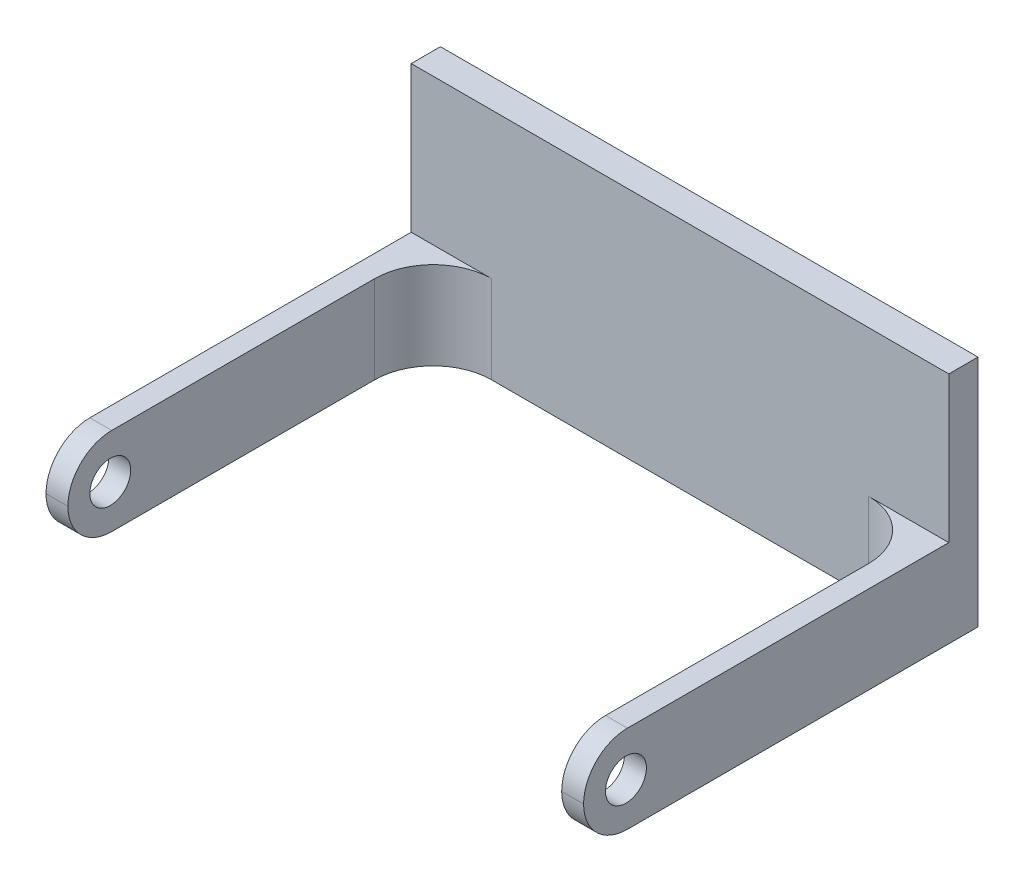
ISO-10303-21;
HEADER;
FILE_DESCRIPTION(('STEP AP214'),'2;1');
FILE_NAME('part.step','',(''),(''),'','','');
FILE_SCHEMA(('AUTOMOTIVE_DESIGN { 1 0 10303 214 1 1 1 1 }'));
ENDSEC;
DATA;
#1=APPLICATION_CONTEXT('core data for automotive mechanical design processes');
#2=APPLICATION_PROTOCOL_DEFINITION('international standard','automotive_design',2000,#1);
#3=PRODUCT_CONTEXT('',#1,'mechanical');
#4=PRODUCT('Part','Part','',(#3));
#5=PRODUCT_RELATED_PRODUCT_CATEGORY('part','',(#4));
#6=PRODUCT_DEFINITION_FORMATION('','',#4);
#7=PRODUCT_DEFINITION_CONTEXT('part definition',#1,'design');
#8=PRODUCT_DEFINITION('design','',#6,#7);
#9=PRODUCT_DEFINITION_SHAPE('','',#8);
#10=(LENGTH_UNIT() NAMED_UNIT(*) SI_UNIT(.MILLI.,.METRE.));
#11=(NAMED_UNIT(*) PLANE_ANGLE_UNIT() SI_UNIT($,.RADIAN.));
#12=(NAMED_UNIT(*) SI_UNIT($,.STERADIAN.) SOLID_ANGLE_UNIT());
#13=UNCERTAINTY_MEASURE_WITH_UNIT(LENGTH_MEASURE(1.E-05),#10,'distance_accuracy_value','');
#14=(GEOMETRIC_REPRESENTATION_CONTEXT(3) GLOBAL_UNCERTAINTY_ASSIGNED_CONTEXT((#13)) GLOBAL_UNIT_ASSIGNED_CONTEXT((#10,
#11,#12)) REPRESENTATION_CONTEXT('',''));
#15=CARTESIAN_POINT('',(0.,0.,0.));
#16=DIRECTION('',(0.,0.,1.));
#17=DIRECTION('',(1.,0.,0.));
#18=AXIS2_PLACEMENT_3D('',#15,#16,#17);
#19=CARTESIAN_POINT('',(-18.4,3.,2.));
#20=DIRECTION('',(0.,-1.,0.));
#21=DIRECTION('',(0.,0.,-1.));
#22=AXIS2_PLACEMENT_3D('',#19,#20,#21);
#23=PLANE('',#22);
#24=DIRECTION('',(1.,0.,0.));
#25=VECTOR('',#24,1.);
#26=CARTESIAN_POINT('',(-18.4,3.,2.));
#27=LINE('',#26,#25);
#28=CARTESIAN_POINT('',(-18.4,3.,2.));
#29=VERTEX_POINT('',#28);
#30=CARTESIAN_POINT('',(-12.9,3.,2.));
#31=VERTEX_POINT('',#30);
#32=EDGE_CURVE('E158',#29,#31,#27,.T.);
#33=ORIENTED_EDGE('',*,*,#32,.F.);
#34=DIRECTION('',(0.,0.,-1.));
#35=VECTOR('',#34,1.);
#36=CARTESIAN_POINT('',(-18.4,3.,2.));
#37=LINE('',#36,#35);
#38=CARTESIAN_POINT('',(-18.4,3.,24.));
#39=VERTEX_POINT('',#38);
#40=EDGE_CURVE('E164',#39,#29,#37,.T.);
#41=ORIENTED_EDGE('',*,*,#40,.F.);
#42=DIRECTION('',(-1.,0.,0.));
#43=VECTOR('',#42,1.);
#44=CARTESIAN_POINT('',(-16.9,3.,24.));
#45=LINE('',#44,#43);
#46=CARTESIAN_POINT('',(-16.9,3.,24.));
#47=VERTEX_POINT('',#46);
#48=EDGE_CURVE('E238',#39,#47,#45,.F.);
#49=ORIENTED_EDGE('',*,*,#48,.T.);
#50=DIRECTION('',(0.,0.,-1.));
#51=VECTOR('',#50,1.);
#52=CARTESIAN_POINT('',(-16.9,3.,27.));
#53=LINE('',#52,#51);
#54=CARTESIAN_POINT('',(-16.9,3.,6.));
#55=VERTEX_POINT('',#54);
#56=EDGE_CURVE('E209',#47,#55,#53,.T.);
#57=ORIENTED_EDGE('',*,*,#56,.T.);
#58=CARTESIAN_POINT('',(-12.9,3.,6.));
#59=DIRECTION('',(0.,-1.,0.));
#60=DIRECTION('',(0.,0.,-1.));
#61=AXIS2_PLACEMENT_3D('',#58,#59,#60);
#62=CIRCLE('',#61,4.);
#63=EDGE_CURVE('E42',#55,#31,#62,.T.);
#64=ORIENTED_EDGE('',*,*,#63,.T.);
#65=EDGE_LOOP('',(#33,#41,#49,#57,#64));
#66=FACE_BOUND('',#65,.T.);
#67=ADVANCED_FACE('F34',(#66),#23,.F.);
#68=CARTESIAN_POINT('',(12.9,3.,2.));
#69=VERTEX_POINT('',#68);
#70=CARTESIAN_POINT('',(18.4,3.,2.));
#71=VERTEX_POINT('',#70);
#72=EDGE_CURVE('E174',#69,#71,#27,.T.);
#73=ORIENTED_EDGE('',*,*,#72,.F.);
#74=CARTESIAN_POINT('',(12.9,3.,6.));
#75=DIRECTION('',(0.,-1.,0.));
#76=DIRECTION('',(0.,0.,-1.));
#77=AXIS2_PLACEMENT_3D('',#74,#75,#76);
#78=CIRCLE('',#77,4.);
#79=CARTESIAN_POINT('',(16.9,3.,6.));
#80=VERTEX_POINT('',#79);
#81=EDGE_CURVE('E323',#69,#80,#78,.T.);
#82=ORIENTED_EDGE('',*,*,#81,.T.);
#83=DIRECTION('',(0.,0.,-1.));
#84=VECTOR('',#83,1.);
#85=CARTESIAN_POINT('',(16.9,3.,27.));
#86=LINE('',#85,#84);
#87=CARTESIAN_POINT('',(16.9,3.,24.));
#88=VERTEX_POINT('',#87);
#89=EDGE_CURVE('E212',#88,#80,#86,.T.);
#90=ORIENTED_EDGE('',*,*,#89,.F.);
#91=DIRECTION('',(-1.,0.,0.));
#92=VECTOR('',#91,1.);
#93=CARTESIAN_POINT('',(-18.4,3.,24.));
#94=LINE('',#93,#92);
#95=CARTESIAN_POINT('',(18.4,3.,24.));
#96=VERTEX_POINT('',#95);
#97=EDGE_CURVE('E236',#88,#96,#94,.F.);
#98=ORIENTED_EDGE('',*,*,#97,.T.);
#99=DIRECTION('',(0.,0.,-1.));
#100=VECTOR('',#99,1.);
#101=CARTESIAN_POINT('',(18.4,3.,2.));
#102=LINE('',#101,#100);
#103=EDGE_CURVE('E201',#96,#71,#102,.T.);
#104=ORIENTED_EDGE('',*,*,#103,.T.);
#105=EDGE_LOOP('',(#73,#82,#90,#98,#104));
#106=FACE_BOUND('',#105,.T.);
#107=ADVANCED_FACE('F285',(#106),#23,.F.);
#108=CARTESIAN_POINT('',(0.,0.,2.));
#109=DIRECTION('',(0.,0.,-1.));
#110=DIRECTION('',(-1.,0.,0.));
#111=AXIS2_PLACEMENT_3D('',#108,#109,#110);
#112=PLANE('',#111);
#113=DIRECTION('',(1.,0.,0.));
#114=VECTOR('',#113,1.);
#115=CARTESIAN_POINT('',(-18.4,-3.,2.));
#116=LINE('',#115,#114);
#117=CARTESIAN_POINT('',(-12.9,-3.,2.));
#118=VERTEX_POINT('',#117);
#119=CARTESIAN_POINT('',(12.9,-3.,2.));
#120=VERTEX_POINT('',#119);
#121=EDGE_CURVE('E190',#118,#120,#116,.T.);
#122=ORIENTED_EDGE('',*,*,#121,.T.);
#123=DIRECTION('',(0.,-1.,0.));
#124=VECTOR('',#123,1.);
#125=CARTESIAN_POINT('',(12.9,3.,2.));
#126=LINE('',#125,#124);
#127=EDGE_CURVE('E325',#120,#69,#126,.F.);
#128=ORIENTED_EDGE('',*,*,#127,.T.);
#129=ORIENTED_EDGE('',*,*,#72,.T.);
#130=DIRECTION('',(0.,-1.,0.));
#131=VECTOR('',#130,1.);
#132=CARTESIAN_POINT('',(18.4,13.,2.));
#133=LINE('',#132,#131);
#134=CARTESIAN_POINT('',(18.4,13.,2.));
#135=VERTEX_POINT('',#134);
#136=EDGE_CURVE('E144',#135,#71,#133,.T.);
#137=ORIENTED_EDGE('',*,*,#136,.F.);
#138=DIRECTION('',(1.,0.,0.));
#139=VECTOR('',#138,1.);
#140=CARTESIAN_POINT('',(-18.4,13.,2.));
#141=LINE('',#140,#139);
#142=CARTESIAN_POINT('',(-18.4,13.,2.));
#143=VERTEX_POINT('',#142);
#144=EDGE_CURVE('E136',#143,#135,#141,.T.);
#145=ORIENTED_EDGE('',*,*,#144,.F.);
#146=DIRECTION('',(0.,-1.,0.));
#147=VECTOR('',#146,1.);
#148=CARTESIAN_POINT('',(-18.4,13.,2.));
#149=LINE('',#148,#147);
#150=EDGE_CURVE('E141',#143,#29,#149,.T.);
#151=ORIENTED_EDGE('',*,*,#150,.T.);
#152=ORIENTED_EDGE('',*,*,#32,.T.);
#153=DIRECTION('',(0.,1.,0.));
#154=VECTOR('',#153,1.);
#155=CARTESIAN_POINT('',(-12.9,-3.,2.));
#156=LINE('',#155,#154);
#157=EDGE_CURVE('E246',#31,#118,#156,.F.);
#158=ORIENTED_EDGE('',*,*,#157,.T.);
#159=EDGE_LOOP('',(#122,#128,#129,#137,#145,#151,#152,#158));
#160=FACE_BOUND('',#159,.T.);
#161=ADVANCED_FACE('F139',(#160),#112,.F.);
#162=CARTESIAN_POINT('',(18.4,-3.,2.));
#163=DIRECTION('',(-1.,0.,0.));
#164=DIRECTION('',(0.,0.,1.));
#165=AXIS2_PLACEMENT_3D('',#162,#163,#164);
#166=PLANE('',#165);
#167=CARTESIAN_POINT('',(18.4,0.,24.1));
#168=DIRECTION('',(1.,0.,0.));
#169=DIRECTION('',(0.,0.,-1.));
#170=AXIS2_PLACEMENT_3D('',#167,#168,#169);
#171=CIRCLE('',#170,1.4);
#172=CARTESIAN_POINT('',(18.4,0.,22.7));
#173=VERTEX_POINT('',#172);
#174=EDGE_CURVE('E242',#173,#173,#171,.T.);
#175=ORIENTED_EDGE('',*,*,#174,.F.);
#176=EDGE_LOOP('',(#175));
#177=FACE_BOUND('',#176,.T.);
#178=CARTESIAN_POINT('',(18.4,0.,24.));
#179=DIRECTION('',(-1.,0.,0.));
#180=DIRECTION('',(0.,0.,1.));
#181=AXIS2_PLACEMENT_3D('',#178,#179,#180);
#182=CIRCLE('',#181,3.);
#183=CARTESIAN_POINT('',(18.4,0.,27.));
#184=VERTEX_POINT('',#183);
#185=EDGE_CURVE('E228',#96,#184,#182,.F.);
#186=ORIENTED_EDGE('',*,*,#185,.T.);
#187=CARTESIAN_POINT('',(18.4,0.,24.));
#188=DIRECTION('',(-1.,0.,0.));
#189=DIRECTION('',(0.,0.,1.));
#190=AXIS2_PLACEMENT_3D('',#187,#188,#189);
#191=CIRCLE('',#190,3.);
#192=CARTESIAN_POINT('',(18.4,-3.,24.));
#193=VERTEX_POINT('',#192);
#194=EDGE_CURVE('E230',#184,#193,#191,.F.);
#195=ORIENTED_EDGE('',*,*,#194,.T.);
#196=DIRECTION('',(0.,0.,-1.));
#197=VECTOR('',#196,1.);
#198=CARTESIAN_POINT('',(18.4,-3.,2.));
#199=LINE('',#198,#197);
#200=CARTESIAN_POINT('',(18.4,-3.,0.));
#201=VERTEX_POINT('',#200);
#202=EDGE_CURVE('E196',#193,#201,#199,.T.);
#203=ORIENTED_EDGE('',*,*,#202,.T.);
#204=DIRECTION('',(0.,1.,0.));
#205=VECTOR('',#204,1.);
#206=CARTESIAN_POINT('',(18.4,-3.,0.));
#207=LINE('',#206,#205);
#208=CARTESIAN_POINT('',(18.4,13.,0.));
#209=VERTEX_POINT('',#208);
#210=EDGE_CURVE('E185',#201,#209,#207,.T.);
#211=ORIENTED_EDGE('',*,*,#210,.T.);
#212=DIRECTION('',(0.,0.,-1.));
#213=VECTOR('',#212,1.);
#214=CARTESIAN_POINT('',(18.4,13.,0.));
#215=LINE('',#214,#213);
#216=EDGE_CURVE('E148',#135,#209,#215,.T.);
#217=ORIENTED_EDGE('',*,*,#216,.F.);
#218=ORIENTED_EDGE('',*,*,#136,.T.);
#219=ORIENTED_EDGE('',*,*,#103,.F.);
#220=EDGE_LOOP('',(#186,#195,#203,#211,#217,#218,#219));
#221=FACE_BOUND('',#220,.T.);
#222=ADVANCED_FACE('F295',(#177,#221),#166,.F.);
#223=CARTESIAN_POINT('',(-18.4,-3.,2.));
#224=DIRECTION('',(1.,0.,0.));
#225=DIRECTION('',(0.,0.,-1.));
#226=AXIS2_PLACEMENT_3D('',#223,#224,#225);
#227=PLANE('',#226);
#228=CARTESIAN_POINT('',(-18.4,0.,24.1));
#229=DIRECTION('',(1.,0.,0.));
#230=DIRECTION('',(0.,0.,-1.));
#231=AXIS2_PLACEMENT_3D('',#228,#229,#230);
#232=CIRCLE('',#231,1.4);
#233=CARTESIAN_POINT('',(-18.4,0.,22.7));
#234=VERTEX_POINT('',#233);
#235=EDGE_CURVE('E260',#234,#234,#232,.T.);
#236=ORIENTED_EDGE('',*,*,#235,.T.);
#237=EDGE_LOOP('',(#236));
#238=FACE_BOUND('',#237,.T.);
#239=DIRECTION('',(0.,0.,-1.));
#240=VECTOR('',#239,1.);
#241=CARTESIAN_POINT('',(-18.4,-3.,2.));
#242=LINE('',#241,#240);
#243=CARTESIAN_POINT('',(-18.4,-3.,24.));
#244=VERTEX_POINT('',#243);
#245=CARTESIAN_POINT('',(-18.4,-3.,0.));
#246=VERTEX_POINT('',#245);
#247=EDGE_CURVE('E198',#244,#246,#242,.T.);
#248=ORIENTED_EDGE('',*,*,#247,.F.);
#249=CARTESIAN_POINT('',(-18.4,0.,24.));
#250=DIRECTION('',(1.,0.,0.));
#251=DIRECTION('',(0.,0.,-1.));
#252=AXIS2_PLACEMENT_3D('',#249,#250,#251);
#253=CIRCLE('',#252,3.);
#254=CARTESIAN_POINT('',(-18.4,0.,27.));
#255=VERTEX_POINT('',#254);
#256=EDGE_CURVE('E226',#244,#255,#253,.F.);
#257=ORIENTED_EDGE('',*,*,#256,.T.);
#258=CARTESIAN_POINT('',(-18.4,0.,24.));
#259=DIRECTION('',(1.,0.,0.));
#260=DIRECTION('',(0.,0.,-1.));
#261=AXIS2_PLACEMENT_3D('',#258,#259,#260);
#262=CIRCLE('',#261,3.);
#263=EDGE_CURVE('E224',#255,#39,#262,.F.);
#264=ORIENTED_EDGE('',*,*,#263,.T.);
#265=ORIENTED_EDGE('',*,*,#40,.T.);
#266=ORIENTED_EDGE('',*,*,#150,.F.);
#267=DIRECTION('',(0.,0.,1.));
#268=VECTOR('',#267,1.);
#269=CARTESIAN_POINT('',(-18.4,13.,0.));
#270=LINE('',#269,#268);
#271=CARTESIAN_POINT('',(-18.4,13.,0.));
#272=VERTEX_POINT('',#271);
#273=EDGE_CURVE('E149',#272,#143,#270,.T.);
#274=ORIENTED_EDGE('',*,*,#273,.F.);
#275=DIRECTION('',(0.,-1.,0.));
#276=VECTOR('',#275,1.);
#277=CARTESIAN_POINT('',(-18.4,-3.,0.));
#278=LINE('',#277,#276);
#279=EDGE_CURVE('E186',#272,#246,#278,.T.);
#280=ORIENTED_EDGE('',*,*,#279,.T.);
#281=EDGE_LOOP('',(#248,#257,#264,#265,#266,#274,#280));
#282=FACE_BOUND('',#281,.T.);
#283=ADVANCED_FACE('F162',(#238,#282),#227,.F.);
#284=CARTESIAN_POINT('',(-18.4,-3.,2.));
#285=DIRECTION('',(0.,1.,0.));
#286=DIRECTION('',(0.,0.,1.));
#287=AXIS2_PLACEMENT_3D('',#284,#285,#286);
#288=PLANE('',#287);
#289=DIRECTION('',(0.,0.,-1.));
#290=VECTOR('',#289,1.);
#291=CARTESIAN_POINT('',(-16.9,-3.,27.));
#292=LINE('',#291,#290);
#293=CARTESIAN_POINT('',(-16.9,-3.,24.));
#294=VERTEX_POINT('',#293);
#295=CARTESIAN_POINT('',(-16.9,-3.,6.));
#296=VERTEX_POINT('',#295);
#297=EDGE_CURVE('E192',#294,#296,#292,.T.);
#298=ORIENTED_EDGE('',*,*,#297,.F.);
#299=DIRECTION('',(1.,0.,0.));
#300=VECTOR('',#299,1.);
#301=CARTESIAN_POINT('',(-18.4,-3.,24.));
#302=LINE('',#301,#300);
#303=EDGE_CURVE('E221',#294,#244,#302,.F.);
#304=ORIENTED_EDGE('',*,*,#303,.T.);
#305=ORIENTED_EDGE('',*,*,#247,.T.);
#306=DIRECTION('',(1.,0.,0.));
#307=VECTOR('',#306,1.);
#308=CARTESIAN_POINT('',(-18.4,-3.,0.));
#309=LINE('',#308,#307);
#310=EDGE_CURVE('E188',#246,#201,#309,.T.);
#311=ORIENTED_EDGE('',*,*,#310,.T.);
#312=ORIENTED_EDGE('',*,*,#202,.F.);
#313=DIRECTION('',(1.,0.,0.));
#314=VECTOR('',#313,1.);
#315=CARTESIAN_POINT('',(-18.4,-3.,24.));
#316=LINE('',#315,#314);
#317=CARTESIAN_POINT('',(16.9,-3.,24.));
#318=VERTEX_POINT('',#317);
#319=EDGE_CURVE('E218',#193,#318,#316,.F.);
#320=ORIENTED_EDGE('',*,*,#319,.T.);
#321=DIRECTION('',(0.,0.,-1.));
#322=VECTOR('',#321,1.);
#323=CARTESIAN_POINT('',(16.9,-3.,27.));
#324=LINE('',#323,#322);
#325=CARTESIAN_POINT('',(16.9,-3.,6.));
#326=VERTEX_POINT('',#325);
#327=EDGE_CURVE('E253',#318,#326,#324,.T.);
#328=ORIENTED_EDGE('',*,*,#327,.T.);
#329=CARTESIAN_POINT('',(12.9,-3.,6.));
#330=DIRECTION('',(0.,1.,0.));
#331=DIRECTION('',(0.,0.,1.));
#332=AXIS2_PLACEMENT_3D('',#329,#330,#331);
#333=CIRCLE('',#332,4.);
#334=EDGE_CURVE('E327',#326,#120,#333,.T.);
#335=ORIENTED_EDGE('',*,*,#334,.T.);
#336=ORIENTED_EDGE('',*,*,#121,.F.);
#337=CARTESIAN_POINT('',(-12.9,-3.,6.));
#338=DIRECTION('',(0.,1.,0.));
#339=DIRECTION('',(0.,0.,1.));
#340=AXIS2_PLACEMENT_3D('',#337,#338,#339);
#341=CIRCLE('',#340,4.);
#342=EDGE_CURVE('E11',#118,#296,#341,.T.);
#343=ORIENTED_EDGE('',*,*,#342,.T.);
#344=EDGE_LOOP('',(#298,#304,#305,#311,#312,#320,#328,#335,#336,#343));
#345=FACE_BOUND('',#344,.T.);
#346=ADVANCED_FACE('F332',(#345),#288,.F.);
#347=CARTESIAN_POINT('',(0.,0.,0.));
#348=DIRECTION('',(0.,0.,-1.));
#349=DIRECTION('',(-1.,0.,0.));
#350=AXIS2_PLACEMENT_3D('',#347,#348,#349);
#351=PLANE('',#350);
#352=ORIENTED_EDGE('',*,*,#210,.F.);
#353=ORIENTED_EDGE('',*,*,#310,.F.);
#354=ORIENTED_EDGE('',*,*,#279,.F.);
#355=DIRECTION('',(-1.,0.,0.));
#356=VECTOR('',#355,1.);
#357=CARTESIAN_POINT('',(-18.4,13.,0.));
#358=LINE('',#357,#356);
#359=EDGE_CURVE('E155',#209,#272,#358,.T.);
#360=ORIENTED_EDGE('',*,*,#359,.F.);
#361=EDGE_LOOP('',(#352,#353,#354,#360));
#362=FACE_BOUND('',#361,.T.);
#363=ADVANCED_FACE('F183',(#362),#351,.T.);
#364=CARTESIAN_POINT('',(-16.9,3.,27.));
#365=DIRECTION('',(-1.,0.,0.));
#366=DIRECTION('',(0.,0.,1.));
#367=AXIS2_PLACEMENT_3D('',#364,#365,#366);
#368=PLANE('',#367);
#369=CARTESIAN_POINT('',(-16.9,0.,24.1));
#370=DIRECTION('',(-1.,0.,0.));
#371=DIRECTION('',(0.,0.,1.));
#372=AXIS2_PLACEMENT_3D('',#369,#370,#371);
#373=CIRCLE('',#372,1.4);
#374=CARTESIAN_POINT('',(-16.9,0.,25.5));
#375=VERTEX_POINT('',#374);
#376=EDGE_CURVE('E256',#375,#375,#373,.T.);
#377=ORIENTED_EDGE('',*,*,#376,.T.);
#378=EDGE_LOOP('',(#377));
#379=FACE_BOUND('',#378,.T.);
#380=ORIENTED_EDGE('',*,*,#297,.T.);
#381=DIRECTION('',(0.,1.,0.));
#382=VECTOR('',#381,1.);
#383=CARTESIAN_POINT('',(-16.9,3.,6.));
#384=LINE('',#383,#382);
#385=EDGE_CURVE('E329',#296,#55,#384,.T.);
#386=ORIENTED_EDGE('',*,*,#385,.T.);
#387=ORIENTED_EDGE('',*,*,#56,.F.);
#388=CARTESIAN_POINT('',(-16.9,0.,24.));
#389=DIRECTION('',(-1.,0.,0.));
#390=DIRECTION('',(0.,0.,1.));
#391=AXIS2_PLACEMENT_3D('',#388,#389,#390);
#392=CIRCLE('',#391,3.);
#393=CARTESIAN_POINT('',(-16.9,0.,27.));
#394=VERTEX_POINT('',#393);
#395=EDGE_CURVE('E203',#47,#394,#392,.F.);
#396=ORIENTED_EDGE('',*,*,#395,.T.);
#397=CARTESIAN_POINT('',(-16.9,0.,24.));
#398=DIRECTION('',(-1.,0.,0.));
#399=DIRECTION('',(0.,0.,1.));
#400=AXIS2_PLACEMENT_3D('',#397,#398,#399);
#401=CIRCLE('',#400,3.);
#402=EDGE_CURVE('E216',#394,#294,#401,.F.);
#403=ORIENTED_EDGE('',*,*,#402,.T.);
#404=EDGE_LOOP('',(#380,#386,#387,#396,#403));
#405=FACE_BOUND('',#404,.T.);
#406=ADVANCED_FACE('F281',(#379,#405),#368,.F.);
#407=CARTESIAN_POINT('',(16.9,3.,27.));
#408=DIRECTION('',(1.,0.,0.));
#409=DIRECTION('',(0.,0.,-1.));
#410=AXIS2_PLACEMENT_3D('',#407,#408,#409);
#411=PLANE('',#410);
#412=CARTESIAN_POINT('',(16.9,0.,24.1));
#413=DIRECTION('',(1.,0.,0.));
#414=DIRECTION('',(0.,0.,-1.));
#415=AXIS2_PLACEMENT_3D('',#412,#413,#414);
#416=CIRCLE('',#415,1.4);
#417=CARTESIAN_POINT('',(16.9,0.,22.7));
#418=VERTEX_POINT('',#417);
#419=EDGE_CURVE('E213',#418,#418,#416,.T.);
#420=ORIENTED_EDGE('',*,*,#419,.T.);
#421=EDGE_LOOP('',(#420));
#422=FACE_BOUND('',#421,.T.);
#423=ORIENTED_EDGE('',*,*,#89,.T.);
#424=DIRECTION('',(0.,-1.,0.));
#425=VECTOR('',#424,1.);
#426=CARTESIAN_POINT('',(16.9,-3.,6.));
#427=LINE('',#426,#425);
#428=EDGE_CURVE('E240',#80,#326,#427,.T.);
#429=ORIENTED_EDGE('',*,*,#428,.T.);
#430=ORIENTED_EDGE('',*,*,#327,.F.);
#431=CARTESIAN_POINT('',(16.9,0.,24.));
#432=DIRECTION('',(1.,0.,0.));
#433=DIRECTION('',(0.,0.,-1.));
#434=AXIS2_PLACEMENT_3D('',#431,#432,#433);
#435=CIRCLE('',#434,3.);
#436=CARTESIAN_POINT('',(16.9,0.,27.));
#437=VERTEX_POINT('',#436);
#438=EDGE_CURVE('E234',#318,#437,#435,.F.);
#439=ORIENTED_EDGE('',*,*,#438,.T.);
#440=CARTESIAN_POINT('',(16.9,0.,24.));
#441=DIRECTION('',(1.,0.,0.));
#442=DIRECTION('',(0.,0.,-1.));
#443=AXIS2_PLACEMENT_3D('',#440,#441,#442);
#444=CIRCLE('',#443,3.);
#445=EDGE_CURVE('E232',#437,#88,#444,.F.);
#446=ORIENTED_EDGE('',*,*,#445,.T.);
#447=EDGE_LOOP('',(#423,#429,#430,#439,#446));
#448=FACE_BOUND('',#447,.T.);
#449=ADVANCED_FACE('F267',(#422,#448),#411,.F.);
#450=CARTESIAN_POINT('',(-18.4,0.,24.1));
#451=DIRECTION('',(1.,0.,0.));
#452=DIRECTION('',(0.,0.,-1.));
#453=AXIS2_PLACEMENT_3D('',#450,#451,#452);
#454=CYLINDRICAL_SURFACE('',#453,1.4);
#455=ORIENTED_EDGE('',*,*,#174,.T.);
#456=EDGE_LOOP('',(#455));
#457=FACE_BOUND('',#456,.T.);
#458=ORIENTED_EDGE('',*,*,#419,.F.);
#459=EDGE_LOOP('',(#458));
#460=FACE_BOUND('',#459,.T.);
#461=ADVANCED_FACE('F270',(#457,#460),#454,.F.);
#462=ORIENTED_EDGE('',*,*,#235,.F.);
#463=EDGE_LOOP('',(#462));
#464=FACE_BOUND('',#463,.T.);
#465=ORIENTED_EDGE('',*,*,#376,.F.);
#466=EDGE_LOOP('',(#465));
#467=FACE_BOUND('',#466,.T.);
#468=ADVANCED_FACE('F272',(#464,#467),#454,.F.);
#469=CARTESIAN_POINT('',(0.,0.,24.));
#470=DIRECTION('',(1.,0.,0.));
#471=DIRECTION('',(0.,0.,-1.));
#472=AXIS2_PLACEMENT_3D('',#469,#470,#471);
#473=CYLINDRICAL_SURFACE('',#472,3.);
#474=ORIENTED_EDGE('',*,*,#48,.F.);
#475=ORIENTED_EDGE('',*,*,#263,.F.);
#476=DIRECTION('',(-1.,0.,0.));
#477=VECTOR('',#476,1.);
#478=CARTESIAN_POINT('',(-18.4,0.,27.));
#479=LINE('',#478,#477);
#480=EDGE_CURVE('E168',#394,#255,#479,.T.);
#481=ORIENTED_EDGE('',*,*,#480,.F.);
#482=ORIENTED_EDGE('',*,*,#395,.F.);
#483=EDGE_LOOP('',(#474,#475,#481,#482));
#484=FACE_BOUND('',#483,.T.);
#485=ADVANCED_FACE('F279',(#484),#473,.T.);
#486=CARTESIAN_POINT('',(0.,0.,24.));
#487=DIRECTION('',(-1.,0.,0.));
#488=DIRECTION('',(0.,0.,1.));
#489=AXIS2_PLACEMENT_3D('',#486,#487,#488);
#490=CYLINDRICAL_SURFACE('',#489,3.);
#491=ORIENTED_EDGE('',*,*,#256,.F.);
#492=ORIENTED_EDGE('',*,*,#303,.F.);
#493=ORIENTED_EDGE('',*,*,#402,.F.);
#494=ORIENTED_EDGE('',*,*,#480,.T.);
#495=EDGE_LOOP('',(#491,#492,#493,#494));
#496=FACE_BOUND('',#495,.T.);
#497=ADVANCED_FACE('F299',(#496),#490,.T.);
#498=CARTESIAN_POINT('',(0.,0.,24.));
#499=DIRECTION('',(-1.,0.,0.));
#500=DIRECTION('',(0.,0.,1.));
#501=AXIS2_PLACEMENT_3D('',#498,#499,#500);
#502=CYLINDRICAL_SURFACE('',#501,3.);
#503=ORIENTED_EDGE('',*,*,#97,.F.);
#504=ORIENTED_EDGE('',*,*,#445,.F.);
#505=DIRECTION('',(-1.,0.,0.));
#506=VECTOR('',#505,1.);
#507=CARTESIAN_POINT('',(0.,0.,27.));
#508=LINE('',#507,#506);
#509=EDGE_CURVE('E165',#184,#437,#508,.T.);
#510=ORIENTED_EDGE('',*,*,#509,.F.);
#511=ORIENTED_EDGE('',*,*,#185,.F.);
#512=EDGE_LOOP('',(#503,#504,#510,#511));
#513=FACE_BOUND('',#512,.T.);
#514=ADVANCED_FACE('F302',(#513),#502,.T.);
#515=CARTESIAN_POINT('',(0.,0.,24.));
#516=DIRECTION('',(1.,0.,0.));
#517=DIRECTION('',(0.,0.,-1.));
#518=AXIS2_PLACEMENT_3D('',#515,#516,#517);
#519=CYLINDRICAL_SURFACE('',#518,3.);
#520=ORIENTED_EDGE('',*,*,#438,.F.);
#521=ORIENTED_EDGE('',*,*,#319,.F.);
#522=ORIENTED_EDGE('',*,*,#194,.F.);
#523=ORIENTED_EDGE('',*,*,#509,.T.);
#524=EDGE_LOOP('',(#520,#521,#522,#523));
#525=FACE_BOUND('',#524,.T.);
#526=ADVANCED_FACE('F307',(#525),#519,.T.);
#527=CARTESIAN_POINT('',(0.,13.,0.));
#528=DIRECTION('',(0.,1.,0.));
#529=DIRECTION('',(0.,0.,1.));
#530=AXIS2_PLACEMENT_3D('',#527,#528,#529);
#531=PLANE('',#530);
#532=ORIENTED_EDGE('',*,*,#273,.T.);
#533=ORIENTED_EDGE('',*,*,#144,.T.);
#534=ORIENTED_EDGE('',*,*,#216,.T.);
#535=ORIENTED_EDGE('',*,*,#359,.T.);
#536=EDGE_LOOP('',(#532,#533,#534,#535));
#537=FACE_BOUND('',#536,.T.);
#538=ADVANCED_FACE('F153',(#537),#531,.T.);
#539=CARTESIAN_POINT('',(12.9,3.,6.));
#540=DIRECTION('',(0.,1.,0.));
#541=DIRECTION('',(0.,0.,1.));
#542=AXIS2_PLACEMENT_3D('',#539,#540,#541);
#543=CYLINDRICAL_SURFACE('',#542,4.);
#544=ORIENTED_EDGE('',*,*,#81,.F.);
#545=ORIENTED_EDGE('',*,*,#127,.F.);
#546=ORIENTED_EDGE('',*,*,#334,.F.);
#547=ORIENTED_EDGE('',*,*,#428,.F.);
#548=EDGE_LOOP('',(#544,#545,#546,#547));
#549=FACE_BOUND('',#548,.T.);
#550=ADVANCED_FACE('F313',(#549),#543,.F.);
#551=CARTESIAN_POINT('',(-12.9,3.,6.));
#552=DIRECTION('',(0.,-1.,0.));
#553=DIRECTION('',(0.,0.,-1.));
#554=AXIS2_PLACEMENT_3D('',#551,#552,#553);
#555=CYLINDRICAL_SURFACE('',#554,4.);
#556=ORIENTED_EDGE('',*,*,#342,.F.);
#557=ORIENTED_EDGE('',*,*,#157,.F.);
#558=ORIENTED_EDGE('',*,*,#63,.F.);
#559=ORIENTED_EDGE('',*,*,#385,.F.);
#560=EDGE_LOOP('',(#556,#557,#558,#559));
#561=FACE_BOUND('',#560,.T.);
#562=ADVANCED_FACE('F36',(#561),#555,.F.);
#563=CLOSED_SHELL('',(#67,#107,#161,#222,#283,#346,#363,#406,#449,#461,#468,#485,#497,#514,#526,
#538,#550,#562));
#564=MANIFOLD_SOLID_BREP('B2',#563);
#565=ADVANCED_BREP_SHAPE_REPRESENTATION('',(#18,#564),#14);
#566=SHAPE_DEFINITION_REPRESENTATION(#9,#565);
ENDSEC;
END-ISO-10303-21;
